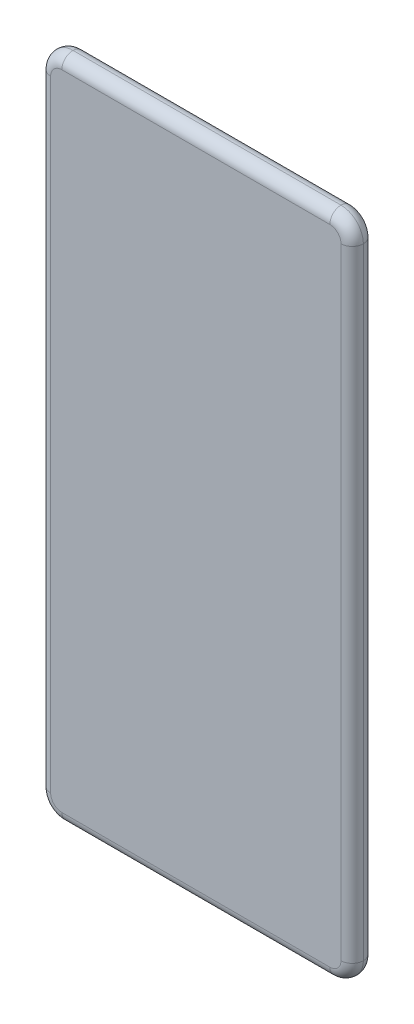
ISO-10303-21;
HEADER;
FILE_DESCRIPTION(('STEP AP214'),'2;1');
FILE_NAME('part.step','',(''),(''),'','','');
FILE_SCHEMA(('AUTOMOTIVE_DESIGN { 1 0 10303 214 1 1 1 1 }'));
ENDSEC;
DATA;
#1=APPLICATION_CONTEXT('core data for automotive mechanical design processes');
#2=APPLICATION_PROTOCOL_DEFINITION('international standard','automotive_design',2000,#1);
#3=PRODUCT_CONTEXT('',#1,'mechanical');
#4=PRODUCT('Part','Part','',(#3));
#5=PRODUCT_RELATED_PRODUCT_CATEGORY('part','',(#4));
#6=PRODUCT_DEFINITION_FORMATION('','',#4);
#7=PRODUCT_DEFINITION_CONTEXT('part definition',#1,'design');
#8=PRODUCT_DEFINITION('design','',#6,#7);
#9=PRODUCT_DEFINITION_SHAPE('','',#8);
#10=(LENGTH_UNIT() NAMED_UNIT(*) SI_UNIT(.MILLI.,.METRE.));
#11=(NAMED_UNIT(*) PLANE_ANGLE_UNIT() SI_UNIT($,.RADIAN.));
#12=(NAMED_UNIT(*) SI_UNIT($,.STERADIAN.) SOLID_ANGLE_UNIT());
#13=UNCERTAINTY_MEASURE_WITH_UNIT(LENGTH_MEASURE(1.E-05),#10,'distance_accuracy_value','');
#14=(GEOMETRIC_REPRESENTATION_CONTEXT(3) GLOBAL_UNCERTAINTY_ASSIGNED_CONTEXT((#13)) GLOBAL_UNIT_ASSIGNED_CONTEXT((#10,
#11,#12)) REPRESENTATION_CONTEXT('',''));
#15=CARTESIAN_POINT('',(0.,0.,0.));
#16=DIRECTION('',(0.,0.,1.));
#17=DIRECTION('',(1.,0.,0.));
#18=AXIS2_PLACEMENT_3D('',#15,#16,#17);
#19=CARTESIAN_POINT('',(-1300.,-2899.,100.));
#20=DIRECTION('',(0.,0.,1.));
#21=DIRECTION('',(1.,0.,0.));
#22=AXIS2_PLACEMENT_3D('',#19,#20,#21);
#23=PLANE('',#22);
#24=DIRECTION('',(0.,-1.,0.));
#25=VECTOR('',#24,1.);
#26=CARTESIAN_POINT('',(-1350.,-2899.,100.));
#27=LINE('',#26,#25);
#28=CARTESIAN_POINT('',(-1350.,-119.,100.));
#29=VERTEX_POINT('',#28);
#30=CARTESIAN_POINT('',(-1350.,-2899.,100.));
#31=VERTEX_POINT('',#30);
#32=EDGE_CURVE('E215',#29,#31,#27,.T.);
#33=ORIENTED_EDGE('',*,*,#32,.T.);
#34=CARTESIAN_POINT('',(-1300.,-2899.,100.));
#35=DIRECTION('',(0.,0.,1.));
#36=DIRECTION('',(1.,0.,0.));
#37=AXIS2_PLACEMENT_3D('',#34,#35,#36);
#38=CIRCLE('',#37,50.0000000000001);
#39=CARTESIAN_POINT('',(-1300.,-2949.,100.));
#40=VERTEX_POINT('',#39);
#41=EDGE_CURVE('E11',#31,#40,#38,.T.);
#42=ORIENTED_EDGE('',*,*,#41,.T.);
#43=DIRECTION('',(1.,0.,0.));
#44=VECTOR('',#43,1.);
#45=CARTESIAN_POINT('',(-99.9999999999996,-2949.,100.));
#46=LINE('',#45,#44);
#47=CARTESIAN_POINT('',(-99.9999999999997,-2949.,100.));
#48=VERTEX_POINT('',#47);
#49=EDGE_CURVE('E50',#40,#48,#46,.T.);
#50=ORIENTED_EDGE('',*,*,#49,.T.);
#51=CARTESIAN_POINT('',(-99.9999999999996,-2899.,100.));
#52=DIRECTION('',(0.,0.,1.));
#53=DIRECTION('',(1.,0.,0.));
#54=AXIS2_PLACEMENT_3D('',#51,#52,#53);
#55=CIRCLE('',#54,50.);
#56=CARTESIAN_POINT('',(-49.9999999999996,-2899.,100.));
#57=VERTEX_POINT('',#56);
#58=EDGE_CURVE('E142',#48,#57,#55,.T.);
#59=ORIENTED_EDGE('',*,*,#58,.T.);
#60=DIRECTION('',(0.,1.,0.));
#61=VECTOR('',#60,1.);
#62=CARTESIAN_POINT('',(-50.,-119.,100.));
#63=LINE('',#62,#61);
#64=CARTESIAN_POINT('',(-50.,-119.,100.));
#65=VERTEX_POINT('',#64);
#66=EDGE_CURVE('E144',#57,#65,#63,.T.);
#67=ORIENTED_EDGE('',*,*,#66,.T.);
#68=CARTESIAN_POINT('',(-100.,-119.,100.));
#69=DIRECTION('',(0.,0.,1.));
#70=DIRECTION('',(1.,0.,0.));
#71=AXIS2_PLACEMENT_3D('',#68,#69,#70);
#72=CIRCLE('',#71,50.);
#73=CARTESIAN_POINT('',(-100.,-68.9999999999999,100.));
#74=VERTEX_POINT('',#73);
#75=EDGE_CURVE('E156',#65,#74,#72,.T.);
#76=ORIENTED_EDGE('',*,*,#75,.T.);
#77=DIRECTION('',(-1.,0.,0.));
#78=VECTOR('',#77,1.);
#79=CARTESIAN_POINT('',(-1300.,-68.9999999999999,100.));
#80=LINE('',#79,#78);
#81=CARTESIAN_POINT('',(-1300.,-69.0000000000001,100.));
#82=VERTEX_POINT('',#81);
#83=EDGE_CURVE('E221',#74,#82,#80,.T.);
#84=ORIENTED_EDGE('',*,*,#83,.T.);
#85=CARTESIAN_POINT('',(-1300.,-119.,100.));
#86=DIRECTION('',(0.,0.,1.));
#87=DIRECTION('',(1.,0.,0.));
#88=AXIS2_PLACEMENT_3D('',#85,#86,#87);
#89=CIRCLE('',#88,50.);
#90=EDGE_CURVE('E218',#82,#29,#89,.T.);
#91=ORIENTED_EDGE('',*,*,#90,.T.);
#92=EDGE_LOOP('',(#33,#42,#50,#59,#67,#76,#84,#91));
#93=FACE_BOUND('',#92,.T.);
#94=ADVANCED_FACE('F39',(#93),#23,.T.);
#95=CARTESIAN_POINT('',(-1300.,-2899.,0.));
#96=DIRECTION('',(0.,0.,1.));
#97=DIRECTION('',(1.,0.,0.));
#98=AXIS2_PLACEMENT_3D('',#95,#96,#97);
#99=PLANE('',#98);
#100=DIRECTION('',(1.,0.,0.));
#101=VECTOR('',#100,1.);
#102=CARTESIAN_POINT('',(-1300.,-2949.,0.));
#103=LINE('',#102,#101);
#104=CARTESIAN_POINT('',(-99.9999999999997,-2949.,0.));
#105=VERTEX_POINT('',#104);
#106=CARTESIAN_POINT('',(-1300.,-2949.,0.));
#107=VERTEX_POINT('',#106);
#108=EDGE_CURVE('E209',#105,#107,#103,.F.);
#109=ORIENTED_EDGE('',*,*,#108,.T.);
#110=CARTESIAN_POINT('',(-1300.,-2899.,0.));
#111=DIRECTION('',(0.,0.,1.));
#112=DIRECTION('',(1.,0.,0.));
#113=AXIS2_PLACEMENT_3D('',#110,#111,#112);
#114=CIRCLE('',#113,50.0000000000001);
#115=CARTESIAN_POINT('',(-1350.,-2899.,0.));
#116=VERTEX_POINT('',#115);
#117=EDGE_CURVE('E212',#107,#116,#114,.F.);
#118=ORIENTED_EDGE('',*,*,#117,.T.);
#119=DIRECTION('',(0.,-1.,0.));
#120=VECTOR('',#119,1.);
#121=CARTESIAN_POINT('',(-1350.,-2899.,0.));
#122=LINE('',#121,#120);
#123=CARTESIAN_POINT('',(-1350.,-119.,0.));
#124=VERTEX_POINT('',#123);
#125=EDGE_CURVE('E187',#116,#124,#122,.F.);
#126=ORIENTED_EDGE('',*,*,#125,.T.);
#127=CARTESIAN_POINT('',(-1300.,-119.,0.));
#128=DIRECTION('',(0.,0.,1.));
#129=DIRECTION('',(1.,0.,0.));
#130=AXIS2_PLACEMENT_3D('',#127,#128,#129);
#131=CIRCLE('',#130,50.);
#132=CARTESIAN_POINT('',(-1300.,-69.0000000000001,0.));
#133=VERTEX_POINT('',#132);
#134=EDGE_CURVE('E189',#124,#133,#131,.F.);
#135=ORIENTED_EDGE('',*,*,#134,.T.);
#136=DIRECTION('',(-1.,0.,0.));
#137=VECTOR('',#136,1.);
#138=CARTESIAN_POINT('',(-1300.,-68.9999999999999,0.));
#139=LINE('',#138,#137);
#140=CARTESIAN_POINT('',(-100.,-69.0000000000001,0.));
#141=VERTEX_POINT('',#140);
#142=EDGE_CURVE('E195',#133,#141,#139,.F.);
#143=ORIENTED_EDGE('',*,*,#142,.T.);
#144=CARTESIAN_POINT('',(-100.,-119.,0.));
#145=DIRECTION('',(0.,0.,1.));
#146=DIRECTION('',(1.,0.,0.));
#147=AXIS2_PLACEMENT_3D('',#144,#145,#146);
#148=CIRCLE('',#147,50.);
#149=CARTESIAN_POINT('',(-50.,-119.,0.));
#150=VERTEX_POINT('',#149);
#151=EDGE_CURVE('E200',#141,#150,#148,.F.);
#152=ORIENTED_EDGE('',*,*,#151,.T.);
#153=DIRECTION('',(0.,1.,0.));
#154=VECTOR('',#153,1.);
#155=CARTESIAN_POINT('',(-49.9999999999996,-2899.,0.));
#156=LINE('',#155,#154);
#157=CARTESIAN_POINT('',(-49.9999999999996,-2899.,0.));
#158=VERTEX_POINT('',#157);
#159=EDGE_CURVE('E203',#150,#158,#156,.F.);
#160=ORIENTED_EDGE('',*,*,#159,.T.);
#161=CARTESIAN_POINT('',(-99.9999999999996,-2899.,0.));
#162=DIRECTION('',(0.,0.,1.));
#163=DIRECTION('',(1.,0.,0.));
#164=AXIS2_PLACEMENT_3D('',#161,#162,#163);
#165=CIRCLE('',#164,50.);
#166=EDGE_CURVE('E206',#158,#105,#165,.F.);
#167=ORIENTED_EDGE('',*,*,#166,.T.);
#168=EDGE_LOOP('',(#109,#118,#126,#135,#143,#152,#160,#167));
#169=FACE_BOUND('',#168,.T.);
#170=ADVANCED_FACE('F316',(#169),#99,.F.);
#171=CARTESIAN_POINT('',(-100.,-119.,50.));
#172=DIRECTION('',(0.,0.,1.));
#173=DIRECTION('',(1.,0.,0.));
#174=AXIS2_PLACEMENT_3D('',#171,#172,#173);
#175=DEGENERATE_TOROIDAL_SURFACE('',#174,50.,50.,.T.);
#176=CARTESIAN_POINT('',(-100.,-69.0000000000001,50.));
#177=DIRECTION('',(-1.,0.,0.));
#178=DIRECTION('',(0.,0.,1.));
#179=AXIS2_PLACEMENT_3D('',#176,#177,#178);
#180=CIRCLE('',#179,50.);
#181=CARTESIAN_POINT('',(-100.,-19.0000000000001,50.));
#182=VERTEX_POINT('',#181);
#183=EDGE_CURVE('E43',#74,#182,#180,.T.);
#184=ORIENTED_EDGE('',*,*,#183,.F.);
#185=ORIENTED_EDGE('',*,*,#75,.F.);
#186=CARTESIAN_POINT('',(-50.,-119.,50.));
#187=DIRECTION('',(0.,-1.,0.));
#188=DIRECTION('',(0.,0.,-1.));
#189=AXIS2_PLACEMENT_3D('',#186,#187,#188);
#190=CIRCLE('',#189,50.);
#191=CARTESIAN_POINT('',(0.,-119.,50.));
#192=VERTEX_POINT('',#191);
#193=EDGE_CURVE('E88',#192,#65,#190,.T.);
#194=ORIENTED_EDGE('',*,*,#193,.F.);
#195=CARTESIAN_POINT('',(-100.,-119.,50.));
#196=DIRECTION('',(0.,0.,1.));
#197=DIRECTION('',(1.,0.,0.));
#198=AXIS2_PLACEMENT_3D('',#195,#196,#197);
#199=CIRCLE('',#198,100.);
#200=EDGE_CURVE('E183',#182,#192,#199,.F.);
#201=ORIENTED_EDGE('',*,*,#200,.F.);
#202=EDGE_LOOP('',(#184,#185,#194,#201));
#203=FACE_BOUND('',#202,.T.);
#204=ADVANCED_FACE('F41',(#203),#175,.T.);
#205=CARTESIAN_POINT('',(-1300.,-68.9999999999999,50.));
#206=DIRECTION('',(1.,0.,0.));
#207=DIRECTION('',(0.,0.,-1.));
#208=AXIS2_PLACEMENT_3D('',#205,#206,#207);
#209=CYLINDRICAL_SURFACE('',#208,50.);
#210=ORIENTED_EDGE('',*,*,#83,.F.);
#211=ORIENTED_EDGE('',*,*,#183,.T.);
#212=DIRECTION('',(-1.,0.,0.));
#213=VECTOR('',#212,1.);
#214=CARTESIAN_POINT('',(-100.,-19.0000000000001,50.));
#215=LINE('',#214,#213);
#216=CARTESIAN_POINT('',(-1300.,-19.0000000000001,50.));
#217=VERTEX_POINT('',#216);
#218=EDGE_CURVE('E170',#217,#182,#215,.F.);
#219=ORIENTED_EDGE('',*,*,#218,.F.);
#220=CARTESIAN_POINT('',(-1300.,-68.9999999999999,50.));
#221=DIRECTION('',(-1.,0.,0.));
#222=DIRECTION('',(0.,0.,1.));
#223=AXIS2_PLACEMENT_3D('',#220,#221,#222);
#224=CIRCLE('',#223,50.);
#225=EDGE_CURVE('E164',#82,#217,#224,.T.);
#226=ORIENTED_EDGE('',*,*,#225,.F.);
#227=EDGE_LOOP('',(#210,#211,#219,#226));
#228=FACE_BOUND('',#227,.T.);
#229=ADVANCED_FACE('F290',(#228),#209,.T.);
#230=CARTESIAN_POINT('',(-49.9999999999996,-2899.,50.));
#231=DIRECTION('',(0.,-1.,0.));
#232=DIRECTION('',(1.,0.,0.));
#233=AXIS2_PLACEMENT_3D('',#230,#231,#232);
#234=CYLINDRICAL_SURFACE('',#233,50.);
#235=ORIENTED_EDGE('',*,*,#193,.T.);
#236=ORIENTED_EDGE('',*,*,#66,.F.);
#237=CARTESIAN_POINT('',(-49.9999999999996,-2899.,50.));
#238=DIRECTION('',(0.,-1.,0.));
#239=DIRECTION('',(0.,0.,-1.));
#240=AXIS2_PLACEMENT_3D('',#237,#238,#239);
#241=CIRCLE('',#240,50.);
#242=CARTESIAN_POINT('',(4.02455846426619E-13,-2899.,50.));
#243=VERTEX_POINT('',#242);
#244=EDGE_CURVE('E153',#243,#57,#241,.T.);
#245=ORIENTED_EDGE('',*,*,#244,.F.);
#246=DIRECTION('',(0.,1.,0.));
#247=VECTOR('',#246,1.);
#248=CARTESIAN_POINT('',(3.60822483003176E-13,-2899.,50.));
#249=LINE('',#248,#247);
#250=EDGE_CURVE('E165',#192,#243,#249,.F.);
#251=ORIENTED_EDGE('',*,*,#250,.F.);
#252=EDGE_LOOP('',(#235,#236,#245,#251));
#253=FACE_BOUND('',#252,.T.);
#254=ADVANCED_FACE('F151',(#253),#234,.T.);
#255=CARTESIAN_POINT('',(-100.,-119.,50.));
#256=DIRECTION('',(0.,0.,1.));
#257=DIRECTION('',(1.,0.,0.));
#258=AXIS2_PLACEMENT_3D('',#255,#256,#257);
#259=DEGENERATE_TOROIDAL_SURFACE('',#258,50.,50.,.T.);
#260=CARTESIAN_POINT('',(-50.,-119.,50.));
#261=DIRECTION('',(0.,-1.,0.));
#262=DIRECTION('',(0.,0.,-1.));
#263=AXIS2_PLACEMENT_3D('',#260,#261,#262);
#264=CIRCLE('',#263,50.);
#265=EDGE_CURVE('E172',#150,#192,#264,.T.);
#266=ORIENTED_EDGE('',*,*,#265,.F.);
#267=ORIENTED_EDGE('',*,*,#151,.F.);
#268=CARTESIAN_POINT('',(-100.,-69.0000000000001,50.));
#269=DIRECTION('',(-1.,0.,0.));
#270=DIRECTION('',(0.,0.,1.));
#271=AXIS2_PLACEMENT_3D('',#268,#269,#270);
#272=CIRCLE('',#271,50.);
#273=EDGE_CURVE('E179',#182,#141,#272,.T.);
#274=ORIENTED_EDGE('',*,*,#273,.F.);
#275=ORIENTED_EDGE('',*,*,#200,.T.);
#276=EDGE_LOOP('',(#266,#267,#274,#275));
#277=FACE_BOUND('',#276,.T.);
#278=ADVANCED_FACE('F287',(#277),#259,.T.);
#279=CARTESIAN_POINT('',(-1300.,-69.0000000000001,50.));
#280=DIRECTION('',(-1.,0.,0.));
#281=DIRECTION('',(0.,0.,1.));
#282=AXIS2_PLACEMENT_3D('',#279,#280,#281);
#283=CYLINDRICAL_SURFACE('',#282,50.);
#284=ORIENTED_EDGE('',*,*,#273,.T.);
#285=ORIENTED_EDGE('',*,*,#142,.F.);
#286=CARTESIAN_POINT('',(-1300.,-69.0000000000001,50.));
#287=DIRECTION('',(-1.,0.,0.));
#288=DIRECTION('',(0.,0.,1.));
#289=AXIS2_PLACEMENT_3D('',#286,#287,#288);
#290=CIRCLE('',#289,50.);
#291=EDGE_CURVE('E275',#217,#133,#290,.T.);
#292=ORIENTED_EDGE('',*,*,#291,.F.);
#293=ORIENTED_EDGE('',*,*,#218,.T.);
#294=EDGE_LOOP('',(#284,#285,#292,#293));
#295=FACE_BOUND('',#294,.T.);
#296=ADVANCED_FACE('F402',(#295),#283,.T.);
#297=CARTESIAN_POINT('',(-1300.,-119.,50.));
#298=DIRECTION('',(0.,0.,1.));
#299=DIRECTION('',(1.,0.,0.));
#300=AXIS2_PLACEMENT_3D('',#297,#298,#299);
#301=TOROIDAL_SURFACE('',#300,50.,50.);
#302=ORIENTED_EDGE('',*,*,#90,.F.);
#303=ORIENTED_EDGE('',*,*,#225,.T.);
#304=CARTESIAN_POINT('',(-1300.,-119.,50.));
#305=DIRECTION('',(0.,0.,1.));
#306=DIRECTION('',(1.,0.,0.));
#307=AXIS2_PLACEMENT_3D('',#304,#305,#306);
#308=CIRCLE('',#307,100.);
#309=CARTESIAN_POINT('',(-1400.,-119.,50.));
#310=VERTEX_POINT('',#309);
#311=EDGE_CURVE('E271',#310,#217,#308,.F.);
#312=ORIENTED_EDGE('',*,*,#311,.F.);
#313=CARTESIAN_POINT('',(-1350.,-119.,50.));
#314=DIRECTION('',(0.,-1.,0.));
#315=DIRECTION('',(0.,0.,-1.));
#316=AXIS2_PLACEMENT_3D('',#313,#314,#315);
#317=CIRCLE('',#316,50.);
#318=EDGE_CURVE('E267',#29,#310,#317,.T.);
#319=ORIENTED_EDGE('',*,*,#318,.F.);
#320=EDGE_LOOP('',(#302,#303,#312,#319));
#321=FACE_BOUND('',#320,.T.);
#322=ADVANCED_FACE('F296',(#321),#301,.T.);
#323=CARTESIAN_POINT('',(-99.9999999999996,-2899.,50.));
#324=DIRECTION('',(0.,0.,1.));
#325=DIRECTION('',(1.,0.,0.));
#326=AXIS2_PLACEMENT_3D('',#323,#324,#325);
#327=TOROIDAL_SURFACE('',#326,50.,50.);
#328=ORIENTED_EDGE('',*,*,#244,.T.);
#329=ORIENTED_EDGE('',*,*,#58,.F.);
#330=CARTESIAN_POINT('',(-99.9999999999997,-2949.,50.));
#331=DIRECTION('',(-1.,0.,0.));
#332=DIRECTION('',(0.,0.,1.));
#333=AXIS2_PLACEMENT_3D('',#330,#331,#332);
#334=CIRCLE('',#333,50.);
#335=CARTESIAN_POINT('',(-99.9999999999997,-2999.,50.));
#336=VERTEX_POINT('',#335);
#337=EDGE_CURVE('E264',#336,#48,#334,.T.);
#338=ORIENTED_EDGE('',*,*,#337,.F.);
#339=CARTESIAN_POINT('',(-99.9999999999996,-2899.,50.));
#340=DIRECTION('',(0.,0.,1.));
#341=DIRECTION('',(1.,0.,0.));
#342=AXIS2_PLACEMENT_3D('',#339,#340,#341);
#343=CIRCLE('',#342,100.);
#344=EDGE_CURVE('E161',#243,#336,#343,.F.);
#345=ORIENTED_EDGE('',*,*,#344,.F.);
#346=EDGE_LOOP('',(#328,#329,#338,#345));
#347=FACE_BOUND('',#346,.T.);
#348=ADVANCED_FACE('F159',(#347),#327,.T.);
#349=CARTESIAN_POINT('',(-50.,-119.,50.));
#350=DIRECTION('',(0.,1.,0.));
#351=DIRECTION('',(-1.,0.,0.));
#352=AXIS2_PLACEMENT_3D('',#349,#350,#351);
#353=CYLINDRICAL_SURFACE('',#352,50.);
#354=ORIENTED_EDGE('',*,*,#265,.T.);
#355=ORIENTED_EDGE('',*,*,#250,.T.);
#356=CARTESIAN_POINT('',(-49.9999999999996,-2899.,50.));
#357=DIRECTION('',(0.,-1.,0.));
#358=DIRECTION('',(0.,0.,-1.));
#359=AXIS2_PLACEMENT_3D('',#356,#357,#358);
#360=CIRCLE('',#359,50.);
#361=EDGE_CURVE('E259',#158,#243,#360,.T.);
#362=ORIENTED_EDGE('',*,*,#361,.F.);
#363=ORIENTED_EDGE('',*,*,#159,.F.);
#364=EDGE_LOOP('',(#354,#355,#362,#363));
#365=FACE_BOUND('',#364,.T.);
#366=ADVANCED_FACE('F283',(#365),#353,.T.);
#367=CARTESIAN_POINT('',(-1300.,-119.,50.));
#368=DIRECTION('',(0.,0.,1.));
#369=DIRECTION('',(1.,0.,0.));
#370=AXIS2_PLACEMENT_3D('',#367,#368,#369);
#371=TOROIDAL_SURFACE('',#370,50.,50.);
#372=ORIENTED_EDGE('',*,*,#291,.T.);
#373=ORIENTED_EDGE('',*,*,#134,.F.);
#374=CARTESIAN_POINT('',(-1350.,-119.,50.));
#375=DIRECTION('',(0.,-1.,0.));
#376=DIRECTION('',(0.,0.,-1.));
#377=AXIS2_PLACEMENT_3D('',#374,#375,#376);
#378=CIRCLE('',#377,50.);
#379=EDGE_CURVE('E255',#310,#124,#378,.T.);
#380=ORIENTED_EDGE('',*,*,#379,.F.);
#381=ORIENTED_EDGE('',*,*,#311,.T.);
#382=EDGE_LOOP('',(#372,#373,#380,#381));
#383=FACE_BOUND('',#382,.T.);
#384=ADVANCED_FACE('F368',(#383),#371,.T.);
#385=CARTESIAN_POINT('',(-1350.,-2899.,50.));
#386=DIRECTION('',(0.,1.,0.));
#387=DIRECTION('',(-1.,0.,0.));
#388=AXIS2_PLACEMENT_3D('',#385,#386,#387);
#389=CYLINDRICAL_SURFACE('',#388,50.);
#390=ORIENTED_EDGE('',*,*,#32,.F.);
#391=ORIENTED_EDGE('',*,*,#318,.T.);
#392=DIRECTION('',(0.,-1.,0.));
#393=VECTOR('',#392,1.);
#394=CARTESIAN_POINT('',(-1400.,-119.,50.));
#395=LINE('',#394,#393);
#396=CARTESIAN_POINT('',(-1400.,-2899.,50.));
#397=VERTEX_POINT('',#396);
#398=EDGE_CURVE('E251',#397,#310,#395,.F.);
#399=ORIENTED_EDGE('',*,*,#398,.F.);
#400=CARTESIAN_POINT('',(-1350.,-2899.,50.));
#401=DIRECTION('',(0.,-1.,0.));
#402=DIRECTION('',(0.,0.,-1.));
#403=AXIS2_PLACEMENT_3D('',#400,#401,#402);
#404=CIRCLE('',#403,50.);
#405=EDGE_CURVE('E247',#31,#397,#404,.T.);
#406=ORIENTED_EDGE('',*,*,#405,.F.);
#407=EDGE_LOOP('',(#390,#391,#399,#406));
#408=FACE_BOUND('',#407,.T.);
#409=ADVANCED_FACE('F299',(#408),#389,.T.);
#410=CARTESIAN_POINT('',(-1300.,-2949.,50.));
#411=DIRECTION('',(-1.,0.,0.));
#412=DIRECTION('',(0.,0.,1.));
#413=AXIS2_PLACEMENT_3D('',#410,#411,#412);
#414=CYLINDRICAL_SURFACE('',#413,50.);
#415=ORIENTED_EDGE('',*,*,#337,.T.);
#416=ORIENTED_EDGE('',*,*,#49,.F.);
#417=CARTESIAN_POINT('',(-1300.,-2949.,50.));
#418=DIRECTION('',(-1.,0.,0.));
#419=DIRECTION('',(0.,0.,1.));
#420=AXIS2_PLACEMENT_3D('',#417,#418,#419);
#421=CIRCLE('',#420,50.);
#422=CARTESIAN_POINT('',(-1300.,-2999.,50.));
#423=VERTEX_POINT('',#422);
#424=EDGE_CURVE('E59',#423,#40,#421,.T.);
#425=ORIENTED_EDGE('',*,*,#424,.F.);
#426=DIRECTION('',(1.,0.,0.));
#427=VECTOR('',#426,1.);
#428=CARTESIAN_POINT('',(-1300.,-2999.,50.));
#429=LINE('',#428,#427);
#430=EDGE_CURVE('E241',#336,#423,#429,.F.);
#431=ORIENTED_EDGE('',*,*,#430,.F.);
#432=EDGE_LOOP('',(#415,#416,#425,#431));
#433=FACE_BOUND('',#432,.T.);
#434=ADVANCED_FACE('F349',(#433),#414,.T.);
#435=CARTESIAN_POINT('',(-99.9999999999996,-2899.,50.));
#436=DIRECTION('',(0.,0.,1.));
#437=DIRECTION('',(1.,0.,0.));
#438=AXIS2_PLACEMENT_3D('',#435,#436,#437);
#439=TOROIDAL_SURFACE('',#438,50.,50.);
#440=ORIENTED_EDGE('',*,*,#361,.T.);
#441=ORIENTED_EDGE('',*,*,#344,.T.);
#442=CARTESIAN_POINT('',(-99.9999999999997,-2949.,50.));
#443=DIRECTION('',(-1.,0.,0.));
#444=DIRECTION('',(0.,0.,1.));
#445=AXIS2_PLACEMENT_3D('',#442,#443,#444);
#446=CIRCLE('',#445,50.);
#447=EDGE_CURVE('E237',#105,#336,#446,.T.);
#448=ORIENTED_EDGE('',*,*,#447,.F.);
#449=ORIENTED_EDGE('',*,*,#166,.F.);
#450=EDGE_LOOP('',(#440,#441,#448,#449));
#451=FACE_BOUND('',#450,.T.);
#452=ADVANCED_FACE('F312',(#451),#439,.T.);
#453=CARTESIAN_POINT('',(-1350.,-119.,50.));
#454=DIRECTION('',(0.,-1.,0.));
#455=DIRECTION('',(1.,0.,0.));
#456=AXIS2_PLACEMENT_3D('',#453,#454,#455);
#457=CYLINDRICAL_SURFACE('',#456,50.);
#458=ORIENTED_EDGE('',*,*,#379,.T.);
#459=ORIENTED_EDGE('',*,*,#125,.F.);
#460=CARTESIAN_POINT('',(-1350.,-2899.,50.));
#461=DIRECTION('',(0.,-1.,0.));
#462=DIRECTION('',(0.,0.,-1.));
#463=AXIS2_PLACEMENT_3D('',#460,#461,#462);
#464=CIRCLE('',#463,50.);
#465=EDGE_CURVE('E102',#397,#116,#464,.T.);
#466=ORIENTED_EDGE('',*,*,#465,.F.);
#467=ORIENTED_EDGE('',*,*,#398,.T.);
#468=EDGE_LOOP('',(#458,#459,#466,#467));
#469=FACE_BOUND('',#468,.T.);
#470=ADVANCED_FACE('F303',(#469),#457,.T.);
#471=CARTESIAN_POINT('',(-1300.,-2899.,50.));
#472=DIRECTION('',(0.,0.,1.));
#473=DIRECTION('',(1.,0.,0.));
#474=AXIS2_PLACEMENT_3D('',#471,#472,#473);
#475=TOROIDAL_SURFACE('',#474,50.0000000000001,50.);
#476=ORIENTED_EDGE('',*,*,#41,.F.);
#477=ORIENTED_EDGE('',*,*,#405,.T.);
#478=CARTESIAN_POINT('',(-1300.,-2899.,50.));
#479=DIRECTION('',(0.,0.,1.));
#480=DIRECTION('',(1.,0.,0.));
#481=AXIS2_PLACEMENT_3D('',#478,#479,#480);
#482=CIRCLE('',#481,100.);
#483=EDGE_CURVE('E232',#423,#397,#482,.F.);
#484=ORIENTED_EDGE('',*,*,#483,.F.);
#485=ORIENTED_EDGE('',*,*,#424,.T.);
#486=EDGE_LOOP('',(#476,#477,#484,#485));
#487=FACE_BOUND('',#486,.T.);
#488=ADVANCED_FACE('F300',(#487),#475,.T.);
#489=CARTESIAN_POINT('',(-1300.,-2949.,50.));
#490=DIRECTION('',(1.,0.,0.));
#491=DIRECTION('',(0.,0.,-1.));
#492=AXIS2_PLACEMENT_3D('',#489,#490,#491);
#493=CYLINDRICAL_SURFACE('',#492,50.);
#494=ORIENTED_EDGE('',*,*,#447,.T.);
#495=ORIENTED_EDGE('',*,*,#430,.T.);
#496=CARTESIAN_POINT('',(-1300.,-2949.,50.));
#497=DIRECTION('',(-1.,0.,0.));
#498=DIRECTION('',(0.,-1.,0.));
#499=AXIS2_PLACEMENT_3D('',#496,#497,#498);
#500=CIRCLE('',#499,50.);
#501=EDGE_CURVE('E228',#107,#423,#500,.T.);
#502=ORIENTED_EDGE('',*,*,#501,.F.);
#503=ORIENTED_EDGE('',*,*,#108,.F.);
#504=EDGE_LOOP('',(#494,#495,#502,#503));
#505=FACE_BOUND('',#504,.T.);
#506=ADVANCED_FACE('F302',(#505),#493,.T.);
#507=CARTESIAN_POINT('',(-1300.,-2899.,50.));
#508=DIRECTION('',(0.,0.,1.));
#509=DIRECTION('',(1.,0.,0.));
#510=AXIS2_PLACEMENT_3D('',#507,#508,#509);
#511=TOROIDAL_SURFACE('',#510,50.0000000000001,50.);
#512=ORIENTED_EDGE('',*,*,#465,.T.);
#513=ORIENTED_EDGE('',*,*,#117,.F.);
#514=ORIENTED_EDGE('',*,*,#501,.T.);
#515=ORIENTED_EDGE('',*,*,#483,.T.);
#516=EDGE_LOOP('',(#512,#513,#514,#515));
#517=FACE_BOUND('',#516,.T.);
#518=ADVANCED_FACE('F309',(#517),#511,.T.);
#519=CLOSED_SHELL('',(#94,#170,#204,#229,#254,#278,#296,#322,#348,#366,#384,#409,#434,#452,#470,
#488,#506,#518));
#520=MANIFOLD_SOLID_BREP('B2',#519);
#521=ADVANCED_BREP_SHAPE_REPRESENTATION('',(#18,#520),#14);
#522=SHAPE_DEFINITION_REPRESENTATION(#9,#521);
ENDSEC;
END-ISO-10303-21;
